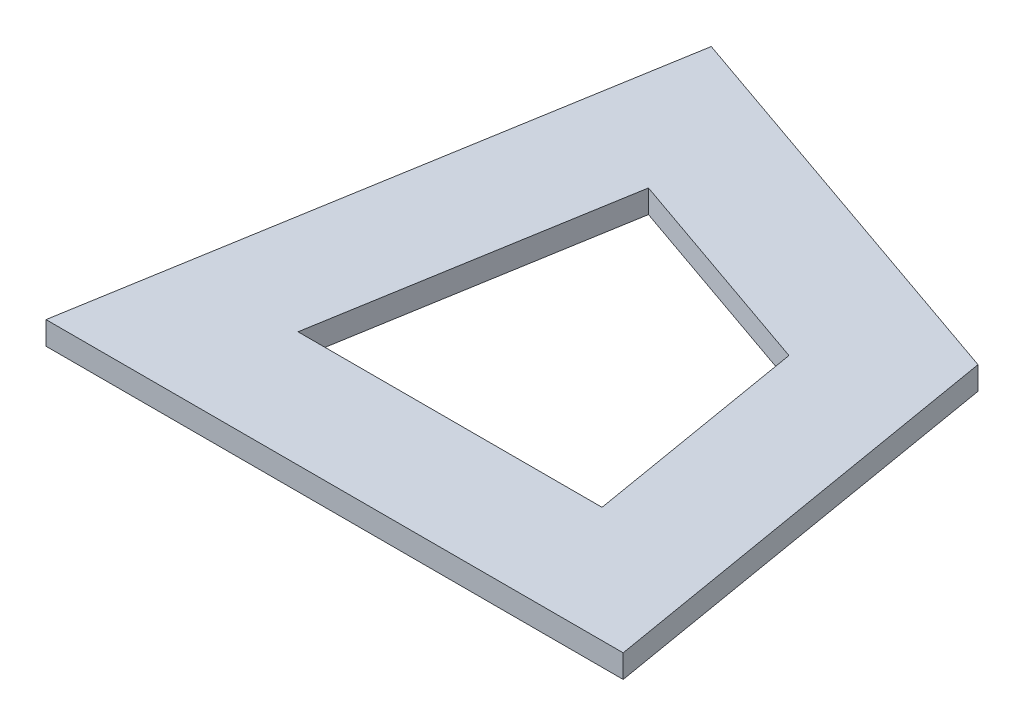
ISO-10303-21;
HEADER;
FILE_DESCRIPTION(('STEP AP214'),'2;1');
FILE_NAME('part.step','',(''),(''),'','','');
FILE_SCHEMA(('AUTOMOTIVE_DESIGN { 1 0 10303 214 1 1 1 1 }'));
ENDSEC;
DATA;
#1=APPLICATION_CONTEXT('core data for automotive mechanical design processes');
#2=APPLICATION_PROTOCOL_DEFINITION('international standard','automotive_design',2000,#1);
#3=PRODUCT_CONTEXT('',#1,'mechanical');
#4=PRODUCT('Part','Part','',(#3));
#5=PRODUCT_RELATED_PRODUCT_CATEGORY('part','',(#4));
#6=PRODUCT_DEFINITION_FORMATION('','',#4);
#7=PRODUCT_DEFINITION_CONTEXT('part definition',#1,'design');
#8=PRODUCT_DEFINITION('design','',#6,#7);
#9=PRODUCT_DEFINITION_SHAPE('','',#8);
#10=(LENGTH_UNIT() NAMED_UNIT(*) SI_UNIT(.MILLI.,.METRE.));
#11=(NAMED_UNIT(*) PLANE_ANGLE_UNIT() SI_UNIT($,.RADIAN.));
#12=(NAMED_UNIT(*) SI_UNIT($,.STERADIAN.) SOLID_ANGLE_UNIT());
#13=UNCERTAINTY_MEASURE_WITH_UNIT(LENGTH_MEASURE(1.E-05),#10,'distance_accuracy_value','');
#14=(GEOMETRIC_REPRESENTATION_CONTEXT(3) GLOBAL_UNCERTAINTY_ASSIGNED_CONTEXT((#13)) GLOBAL_UNIT_ASSIGNED_CONTEXT((#10,
#11,#12)) REPRESENTATION_CONTEXT('',''));
#15=CARTESIAN_POINT('',(0.,0.,0.));
#16=DIRECTION('',(0.,0.,1.));
#17=DIRECTION('',(1.,0.,0.));
#18=AXIS2_PLACEMENT_3D('',#15,#16,#17);
#19=CARTESIAN_POINT('',(0.,2.,0.));
#20=DIRECTION('',(0.,-1.,0.));
#21=DIRECTION('',(0.,0.,-1.));
#22=AXIS2_PLACEMENT_3D('',#19,#20,#21);
#23=PLANE('',#22);
#24=DIRECTION('',(-0.166596655404362,0.,0.986025128689974));
#25=VECTOR('',#24,1.);
#26=CARTESIAN_POINT('',(8.32983277021808,2.,-49.3012564344987));
#27=LINE('',#26,#25);
#28=CARTESIAN_POINT('',(8.32983277021808,2.,-49.3012564344987));
#29=VERTEX_POINT('',#28);
#30=CARTESIAN_POINT('',(0.,2.,0.));
#31=VERTEX_POINT('',#30);
#32=EDGE_CURVE('E140',#29,#31,#27,.T.);
#33=ORIENTED_EDGE('',*,*,#32,.T.);
#34=DIRECTION('',(1.,0.,0.));
#35=VECTOR('',#34,1.);
#36=CARTESIAN_POINT('',(0.,2.,0.));
#37=LINE('',#36,#35);
#38=CARTESIAN_POINT('',(50.,2.,0.));
#39=VERTEX_POINT('',#38);
#40=EDGE_CURVE('E143',#31,#39,#37,.T.);
#41=ORIENTED_EDGE('',*,*,#40,.T.);
#42=DIRECTION('',(-0.166596655404362,0.,-0.986025128689974));
#43=VECTOR('',#42,1.);
#44=CARTESIAN_POINT('',(50.,2.,0.));
#45=LINE('',#44,#43);
#46=CARTESIAN_POINT('',(43.7506057368177,2.,-36.9878961113129));
#47=VERTEX_POINT('',#46);
#48=EDGE_CURVE('E146',#39,#47,#45,.T.);
#49=ORIENTED_EDGE('',*,*,#48,.T.);
#50=DIRECTION('',(-0.94455394577599,0.,-0.328356275284954));
#51=VECTOR('',#50,1.);
#52=CARTESIAN_POINT('',(43.7506057368177,2.,-36.9878961113129));
#53=LINE('',#52,#51);
#54=EDGE_CURVE('E148',#47,#29,#53,.T.);
#55=ORIENTED_EDGE('',*,*,#54,.T.);
#56=EDGE_LOOP('',(#33,#41,#49,#55));
#57=FACE_BOUND('',#56,.T.);
#58=DIRECTION('',(-0.94455394577599,0.,-0.328356275284954));
#59=VECTOR('',#58,1.);
#60=CARTESIAN_POINT('',(34.8764082865852,2.,-29.4858348359488));
#61=LINE('',#60,#59);
#62=CARTESIAN_POINT('',(34.8764082865852,2.,-29.4858348359488));
#63=VERTEX_POINT('',#62);
#64=CARTESIAN_POINT('',(16.2194101845095,2.,-35.971586583842));
#65=VERTEX_POINT('',#64);
#66=EDGE_CURVE('E104',#63,#65,#61,.T.);
#67=ORIENTED_EDGE('',*,*,#66,.F.);
#68=DIRECTION('',(-0.166596655404362,0.,-0.986025128689974));
#69=VECTOR('',#68,1.);
#70=CARTESIAN_POINT('',(38.1686924454523,2.,-10.));
#71=LINE('',#70,#69);
#72=CARTESIAN_POINT('',(38.1686924454523,2.,-10.));
#73=VERTEX_POINT('',#72);
#74=EDGE_CURVE('E126',#73,#63,#71,.T.);
#75=ORIENTED_EDGE('',*,*,#74,.F.);
#76=DIRECTION('',(1.,0.,0.));
#77=VECTOR('',#76,1.);
#78=CARTESIAN_POINT('',(11.8313075545478,2.,-10.));
#79=LINE('',#78,#77);
#80=CARTESIAN_POINT('',(11.8313075545478,2.,-10.));
#81=VERTEX_POINT('',#80);
#82=EDGE_CURVE('E124',#81,#73,#79,.T.);
#83=ORIENTED_EDGE('',*,*,#82,.F.);
#84=DIRECTION('',(-0.166596655404361,0.,0.986025128689974));
#85=VECTOR('',#84,1.);
#86=CARTESIAN_POINT('',(16.2194101845095,2.,-35.971586583842));
#87=LINE('',#86,#85);
#88=EDGE_CURVE('E112',#65,#81,#87,.T.);
#89=ORIENTED_EDGE('',*,*,#88,.F.);
#90=EDGE_LOOP('',(#67,#75,#83,#89));
#91=FACE_BOUND('',#90,.T.);
#92=ADVANCED_FACE('F39',(#57,#91),#23,.F.);
#93=CARTESIAN_POINT('',(0.,0.,0.));
#94=DIRECTION('',(0.,-1.,0.));
#95=DIRECTION('',(0.,0.,-1.));
#96=AXIS2_PLACEMENT_3D('',#93,#94,#95);
#97=PLANE('',#96);
#98=DIRECTION('',(-0.166596655404362,0.,0.986025128689974));
#99=VECTOR('',#98,1.);
#100=CARTESIAN_POINT('',(8.32983277021808,0.,-49.3012564344987));
#101=LINE('',#100,#99);
#102=CARTESIAN_POINT('',(8.32983277021808,0.,-49.3012564344987));
#103=VERTEX_POINT('',#102);
#104=CARTESIAN_POINT('',(0.,0.,0.));
#105=VERTEX_POINT('',#104);
#106=EDGE_CURVE('E120',#103,#105,#101,.T.);
#107=ORIENTED_EDGE('',*,*,#106,.F.);
#108=DIRECTION('',(-0.94455394577599,0.,-0.328356275284954));
#109=VECTOR('',#108,1.);
#110=CARTESIAN_POINT('',(43.7506057368177,0.,-36.9878961113129));
#111=LINE('',#110,#109);
#112=CARTESIAN_POINT('',(43.7506057368177,0.,-36.9878961113129));
#113=VERTEX_POINT('',#112);
#114=EDGE_CURVE('E144',#113,#103,#111,.T.);
#115=ORIENTED_EDGE('',*,*,#114,.F.);
#116=DIRECTION('',(-0.166596655404362,0.,-0.986025128689974));
#117=VECTOR('',#116,1.);
#118=CARTESIAN_POINT('',(50.,0.,0.));
#119=LINE('',#118,#117);
#120=CARTESIAN_POINT('',(50.,0.,0.));
#121=VERTEX_POINT('',#120);
#122=EDGE_CURVE('E155',#121,#113,#119,.T.);
#123=ORIENTED_EDGE('',*,*,#122,.F.);
#124=DIRECTION('',(1.,0.,0.));
#125=VECTOR('',#124,1.);
#126=CARTESIAN_POINT('',(0.,0.,0.));
#127=LINE('',#126,#125);
#128=EDGE_CURVE('E153',#105,#121,#127,.T.);
#129=ORIENTED_EDGE('',*,*,#128,.F.);
#130=EDGE_LOOP('',(#107,#115,#123,#129));
#131=FACE_BOUND('',#130,.T.);
#132=DIRECTION('',(-0.166596655404362,0.,-0.986025128689974));
#133=VECTOR('',#132,1.);
#134=CARTESIAN_POINT('',(38.1686924454523,0.,-10.));
#135=LINE('',#134,#133);
#136=CARTESIAN_POINT('',(38.1686924454523,0.,-10.));
#137=VERTEX_POINT('',#136);
#138=CARTESIAN_POINT('',(34.8764082865852,0.,-29.4858348359488));
#139=VERTEX_POINT('',#138);
#140=EDGE_CURVE('E113',#137,#139,#135,.T.);
#141=ORIENTED_EDGE('',*,*,#140,.T.);
#142=DIRECTION('',(-0.94455394577599,0.,-0.328356275284954));
#143=VECTOR('',#142,1.);
#144=CARTESIAN_POINT('',(34.8764082865852,0.,-29.4858348359488));
#145=LINE('',#144,#143);
#146=CARTESIAN_POINT('',(16.2194101845095,0.,-35.971586583842));
#147=VERTEX_POINT('',#146);
#148=EDGE_CURVE('E62',#139,#147,#145,.T.);
#149=ORIENTED_EDGE('',*,*,#148,.T.);
#150=DIRECTION('',(-0.166596655404361,0.,0.986025128689974));
#151=VECTOR('',#150,1.);
#152=CARTESIAN_POINT('',(16.2194101845095,0.,-35.971586583842));
#153=LINE('',#152,#151);
#154=CARTESIAN_POINT('',(11.8313075545478,0.,-10.));
#155=VERTEX_POINT('',#154);
#156=EDGE_CURVE('E119',#147,#155,#153,.T.);
#157=ORIENTED_EDGE('',*,*,#156,.T.);
#158=DIRECTION('',(1.,0.,0.));
#159=VECTOR('',#158,1.);
#160=CARTESIAN_POINT('',(11.8313075545478,0.,-10.));
#161=LINE('',#160,#159);
#162=EDGE_CURVE('E132',#155,#137,#161,.T.);
#163=ORIENTED_EDGE('',*,*,#162,.T.);
#164=EDGE_LOOP('',(#141,#149,#157,#163));
#165=FACE_BOUND('',#164,.T.);
#166=ADVANCED_FACE('F173',(#131,#165),#97,.T.);
#167=CARTESIAN_POINT('',(8.32983277021808,2.,-49.3012564344987));
#168=DIRECTION('',(0.986025128689974,0.,0.166596655404362));
#169=DIRECTION('',(0.166596655404362,0.,-0.986025128689974));
#170=AXIS2_PLACEMENT_3D('',#167,#168,#169);
#171=PLANE('',#170);
#172=ORIENTED_EDGE('',*,*,#106,.T.);
#173=DIRECTION('',(0.,-1.,0.));
#174=VECTOR('',#173,1.);
#175=CARTESIAN_POINT('',(0.,2.,0.));
#176=LINE('',#175,#174);
#177=EDGE_CURVE('E11',#31,#105,#176,.T.);
#178=ORIENTED_EDGE('',*,*,#177,.F.);
#179=ORIENTED_EDGE('',*,*,#32,.F.);
#180=DIRECTION('',(0.,-1.,0.));
#181=VECTOR('',#180,1.);
#182=CARTESIAN_POINT('',(8.32983277021808,2.,-49.3012564344987));
#183=LINE('',#182,#181);
#184=EDGE_CURVE('E150',#29,#103,#183,.T.);
#185=ORIENTED_EDGE('',*,*,#184,.T.);
#186=EDGE_LOOP('',(#172,#178,#179,#185));
#187=FACE_BOUND('',#186,.T.);
#188=ADVANCED_FACE('F41',(#187),#171,.F.);
#189=CARTESIAN_POINT('',(0.,2.,0.));
#190=DIRECTION('',(0.,0.,-1.));
#191=DIRECTION('',(-1.,0.,0.));
#192=AXIS2_PLACEMENT_3D('',#189,#190,#191);
#193=PLANE('',#192);
#194=ORIENTED_EDGE('',*,*,#128,.T.);
#195=DIRECTION('',(0.,-1.,0.));
#196=VECTOR('',#195,1.);
#197=CARTESIAN_POINT('',(50.,2.,0.));
#198=LINE('',#197,#196);
#199=EDGE_CURVE('E47',#39,#121,#198,.T.);
#200=ORIENTED_EDGE('',*,*,#199,.F.);
#201=ORIENTED_EDGE('',*,*,#40,.F.);
#202=ORIENTED_EDGE('',*,*,#177,.T.);
#203=EDGE_LOOP('',(#194,#200,#201,#202));
#204=FACE_BOUND('',#203,.T.);
#205=ADVANCED_FACE('F183',(#204),#193,.F.);
#206=CARTESIAN_POINT('',(50.,2.,0.));
#207=DIRECTION('',(-0.986025128689974,0.,0.166596655404362));
#208=DIRECTION('',(0.166596655404362,0.,0.986025128689974));
#209=AXIS2_PLACEMENT_3D('',#206,#207,#208);
#210=PLANE('',#209);
#211=ORIENTED_EDGE('',*,*,#122,.T.);
#212=DIRECTION('',(0.,-1.,0.));
#213=VECTOR('',#212,1.);
#214=CARTESIAN_POINT('',(43.7506057368177,2.,-36.9878961113129));
#215=LINE('',#214,#213);
#216=EDGE_CURVE('E160',#47,#113,#215,.T.);
#217=ORIENTED_EDGE('',*,*,#216,.F.);
#218=ORIENTED_EDGE('',*,*,#48,.F.);
#219=ORIENTED_EDGE('',*,*,#199,.T.);
#220=EDGE_LOOP('',(#211,#217,#218,#219));
#221=FACE_BOUND('',#220,.T.);
#222=ADVANCED_FACE('F167',(#221),#210,.F.);
#223=CARTESIAN_POINT('',(43.7506057368177,2.,-36.9878961113129));
#224=DIRECTION('',(-0.328356275284954,0.,0.94455394577599));
#225=DIRECTION('',(0.94455394577599,0.,0.328356275284954));
#226=AXIS2_PLACEMENT_3D('',#223,#224,#225);
#227=PLANE('',#226);
#228=ORIENTED_EDGE('',*,*,#114,.T.);
#229=ORIENTED_EDGE('',*,*,#184,.F.);
#230=ORIENTED_EDGE('',*,*,#54,.F.);
#231=ORIENTED_EDGE('',*,*,#216,.T.);
#232=EDGE_LOOP('',(#228,#229,#230,#231));
#233=FACE_BOUND('',#232,.T.);
#234=ADVANCED_FACE('F177',(#233),#227,.F.);
#235=CARTESIAN_POINT('',(34.8764082865852,2.,-29.4858348359488));
#236=DIRECTION('',(-0.328356275284954,0.,0.94455394577599));
#237=DIRECTION('',(0.94455394577599,0.,0.328356275284954));
#238=AXIS2_PLACEMENT_3D('',#235,#236,#237);
#239=PLANE('',#238);
#240=ORIENTED_EDGE('',*,*,#148,.F.);
#241=DIRECTION('',(0.,-1.,0.));
#242=VECTOR('',#241,1.);
#243=CARTESIAN_POINT('',(34.8764082865852,2.,-29.4858348359488));
#244=LINE('',#243,#242);
#245=EDGE_CURVE('E108',#63,#139,#244,.T.);
#246=ORIENTED_EDGE('',*,*,#245,.F.);
#247=ORIENTED_EDGE('',*,*,#66,.T.);
#248=DIRECTION('',(0.,-1.,0.));
#249=VECTOR('',#248,1.);
#250=CARTESIAN_POINT('',(16.2194101845095,2.,-35.971586583842));
#251=LINE('',#250,#249);
#252=EDGE_CURVE('E107',#65,#147,#251,.T.);
#253=ORIENTED_EDGE('',*,*,#252,.T.);
#254=EDGE_LOOP('',(#240,#246,#247,#253));
#255=FACE_BOUND('',#254,.T.);
#256=ADVANCED_FACE('F106',(#255),#239,.T.);
#257=CARTESIAN_POINT('',(16.2194101845095,2.,-35.971586583842));
#258=DIRECTION('',(0.986025128689974,0.,0.166596655404361));
#259=DIRECTION('',(0.166596655404361,0.,-0.986025128689974));
#260=AXIS2_PLACEMENT_3D('',#257,#258,#259);
#261=PLANE('',#260);
#262=ORIENTED_EDGE('',*,*,#156,.F.);
#263=ORIENTED_EDGE('',*,*,#252,.F.);
#264=ORIENTED_EDGE('',*,*,#88,.T.);
#265=DIRECTION('',(0.,-1.,0.));
#266=VECTOR('',#265,1.);
#267=CARTESIAN_POINT('',(11.8313075545478,2.,-10.));
#268=LINE('',#267,#266);
#269=EDGE_CURVE('E121',#81,#155,#268,.T.);
#270=ORIENTED_EDGE('',*,*,#269,.T.);
#271=EDGE_LOOP('',(#262,#263,#264,#270));
#272=FACE_BOUND('',#271,.T.);
#273=ADVANCED_FACE('F116',(#272),#261,.T.);
#274=CARTESIAN_POINT('',(11.8313075545478,2.,-10.));
#275=DIRECTION('',(0.,0.,-1.));
#276=DIRECTION('',(-1.,0.,0.));
#277=AXIS2_PLACEMENT_3D('',#274,#275,#276);
#278=PLANE('',#277);
#279=ORIENTED_EDGE('',*,*,#162,.F.);
#280=ORIENTED_EDGE('',*,*,#269,.F.);
#281=ORIENTED_EDGE('',*,*,#82,.T.);
#282=DIRECTION('',(0.,-1.,0.));
#283=VECTOR('',#282,1.);
#284=CARTESIAN_POINT('',(38.1686924454523,2.,-10.));
#285=LINE('',#284,#283);
#286=EDGE_CURVE('E54',#73,#137,#285,.T.);
#287=ORIENTED_EDGE('',*,*,#286,.T.);
#288=EDGE_LOOP('',(#279,#280,#281,#287));
#289=FACE_BOUND('',#288,.T.);
#290=ADVANCED_FACE('F206',(#289),#278,.T.);
#291=CARTESIAN_POINT('',(38.1686924454523,2.,-10.));
#292=DIRECTION('',(-0.986025128689974,0.,0.166596655404362));
#293=DIRECTION('',(0.166596655404362,0.,0.986025128689974));
#294=AXIS2_PLACEMENT_3D('',#291,#292,#293);
#295=PLANE('',#294);
#296=ORIENTED_EDGE('',*,*,#140,.F.);
#297=ORIENTED_EDGE('',*,*,#286,.F.);
#298=ORIENTED_EDGE('',*,*,#74,.T.);
#299=ORIENTED_EDGE('',*,*,#245,.T.);
#300=EDGE_LOOP('',(#296,#297,#298,#299));
#301=FACE_BOUND('',#300,.T.);
#302=ADVANCED_FACE('F210',(#301),#295,.T.);
#303=CLOSED_SHELL('',(#92,#166,#188,#205,#222,#234,#256,#273,#290,#302));
#304=MANIFOLD_SOLID_BREP('B2',#303);
#305=ADVANCED_BREP_SHAPE_REPRESENTATION('',(#18,#304),#14);
#306=SHAPE_DEFINITION_REPRESENTATION(#9,#305);
ENDSEC;
END-ISO-10303-21;
